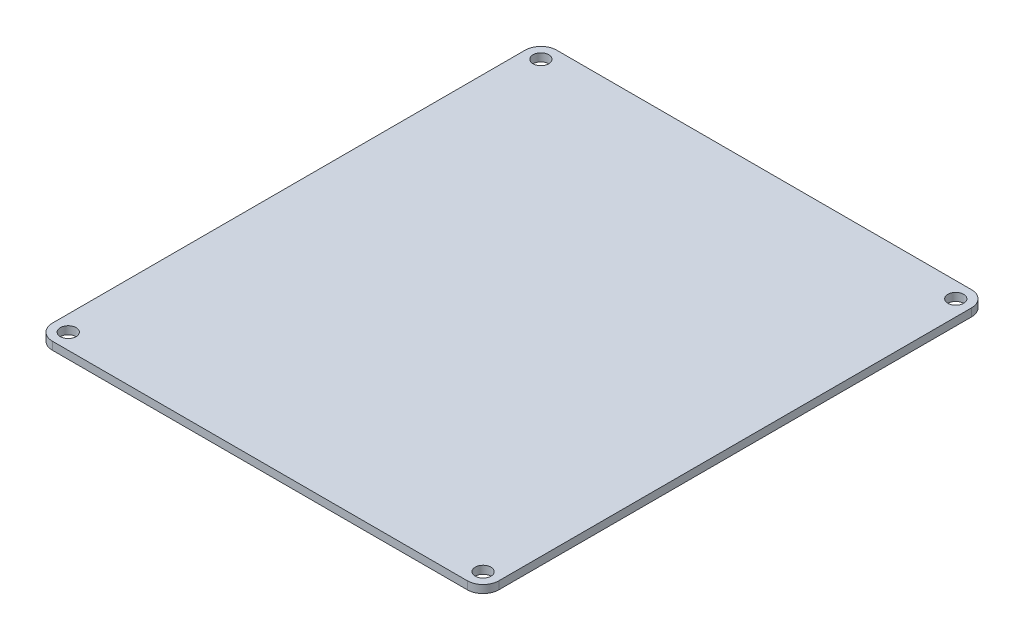
ISO-10303-21;
HEADER;
FILE_DESCRIPTION(('STEP AP214'),'2;1');
FILE_NAME('part.step','',(''),(''),'','','');
FILE_SCHEMA(('AUTOMOTIVE_DESIGN { 1 0 10303 214 1 1 1 1 }'));
ENDSEC;
DATA;
#1=APPLICATION_CONTEXT('core data for automotive mechanical design processes');
#2=APPLICATION_PROTOCOL_DEFINITION('international standard','automotive_design',2000,#1);
#3=PRODUCT_CONTEXT('',#1,'mechanical');
#4=PRODUCT('Part','Part','',(#3));
#5=PRODUCT_RELATED_PRODUCT_CATEGORY('part','',(#4));
#6=PRODUCT_DEFINITION_FORMATION('','',#4);
#7=PRODUCT_DEFINITION_CONTEXT('part definition',#1,'design');
#8=PRODUCT_DEFINITION('design','',#6,#7);
#9=PRODUCT_DEFINITION_SHAPE('','',#8);
#10=(LENGTH_UNIT() NAMED_UNIT(*) SI_UNIT(.MILLI.,.METRE.));
#11=(NAMED_UNIT(*) PLANE_ANGLE_UNIT() SI_UNIT($,.RADIAN.));
#12=(NAMED_UNIT(*) SI_UNIT($,.STERADIAN.) SOLID_ANGLE_UNIT());
#13=UNCERTAINTY_MEASURE_WITH_UNIT(LENGTH_MEASURE(1.E-05),#10,'distance_accuracy_value','');
#14=(GEOMETRIC_REPRESENTATION_CONTEXT(3) GLOBAL_UNCERTAINTY_ASSIGNED_CONTEXT((#13)) GLOBAL_UNIT_ASSIGNED_CONTEXT((#10,
#11,#12)) REPRESENTATION_CONTEXT('',''));
#15=CARTESIAN_POINT('',(0.,0.,0.));
#16=DIRECTION('',(0.,0.,1.));
#17=DIRECTION('',(1.,0.,0.));
#18=AXIS2_PLACEMENT_3D('',#15,#16,#17);
#19=CARTESIAN_POINT('',(-32.800000186,3.175,0.));
#20=DIRECTION('',(1.,0.,0.));
#21=DIRECTION('',(0.,0.,-1.));
#22=AXIS2_PLACEMENT_3D('',#19,#20,#21);
#23=PLANE('',#22);
#24=DIRECTION('',(0.,0.,1.));
#25=VECTOR('',#24,1.);
#26=CARTESIAN_POINT('',(-32.800000186,3.175,0.));
#27=LINE('',#26,#25);
#28=CARTESIAN_POINT('',(-32.800000186,3.175,-196.85));
#29=VERTEX_POINT('',#28);
#30=CARTESIAN_POINT('',(-32.800000186,3.175,-6.35));
#31=VERTEX_POINT('',#30);
#32=EDGE_CURVE('E123',#29,#31,#27,.T.);
#33=ORIENTED_EDGE('',*,*,#32,.F.);
#34=DIRECTION('',(0.,-1.,0.));
#35=VECTOR('',#34,1.);
#36=CARTESIAN_POINT('',(-32.800000186,3.175,-196.85));
#37=LINE('',#36,#35);
#38=CARTESIAN_POINT('',(-32.800000186,0.,-196.85));
#39=VERTEX_POINT('',#38);
#40=EDGE_CURVE('E108',#29,#39,#37,.T.);
#41=ORIENTED_EDGE('',*,*,#40,.T.);
#42=DIRECTION('',(0.,0.,1.));
#43=VECTOR('',#42,1.);
#44=CARTESIAN_POINT('',(-32.800000186,0.,0.));
#45=LINE('',#44,#43);
#46=CARTESIAN_POINT('',(-32.800000186,0.,-6.35));
#47=VERTEX_POINT('',#46);
#48=EDGE_CURVE('E120',#39,#47,#45,.T.);
#49=ORIENTED_EDGE('',*,*,#48,.T.);
#50=DIRECTION('',(0.,-1.,0.));
#51=VECTOR('',#50,1.);
#52=CARTESIAN_POINT('',(-32.800000186,3.175,-6.35));
#53=LINE('',#52,#51);
#54=EDGE_CURVE('E125',#47,#31,#53,.F.);
#55=ORIENTED_EDGE('',*,*,#54,.T.);
#56=EDGE_LOOP('',(#33,#41,#49,#55));
#57=FACE_BOUND('',#56,.T.);
#58=ADVANCED_FACE('F38',(#57),#23,.F.);
#59=CARTESIAN_POINT('',(0.,3.175,0.));
#60=DIRECTION('',(0.,0.,-1.));
#61=DIRECTION('',(-1.,0.,0.));
#62=AXIS2_PLACEMENT_3D('',#59,#60,#61);
#63=PLANE('',#62);
#64=DIRECTION('',(1.,0.,0.));
#65=VECTOR('',#64,1.);
#66=CARTESIAN_POINT('',(0.,0.,0.));
#67=LINE('',#66,#65);
#68=CARTESIAN_POINT('',(-26.450000186,0.,0.));
#69=VERTEX_POINT('',#68);
#70=CARTESIAN_POINT('',(140.750000186,0.,0.));
#71=VERTEX_POINT('',#70);
#72=EDGE_CURVE('E129',#69,#71,#67,.T.);
#73=ORIENTED_EDGE('',*,*,#72,.T.);
#74=DIRECTION('',(0.,-1.,0.));
#75=VECTOR('',#74,1.);
#76=CARTESIAN_POINT('',(140.750000186,3.175,0.));
#77=LINE('',#76,#75);
#78=CARTESIAN_POINT('',(140.750000186,3.175,0.));
#79=VERTEX_POINT('',#78);
#80=EDGE_CURVE('E11',#71,#79,#77,.F.);
#81=ORIENTED_EDGE('',*,*,#80,.T.);
#82=DIRECTION('',(1.,0.,0.));
#83=VECTOR('',#82,1.);
#84=CARTESIAN_POINT('',(0.,3.175,0.));
#85=LINE('',#84,#83);
#86=CARTESIAN_POINT('',(-26.450000186,3.175,0.));
#87=VERTEX_POINT('',#86);
#88=EDGE_CURVE('E169',#87,#79,#85,.T.);
#89=ORIENTED_EDGE('',*,*,#88,.F.);
#90=DIRECTION('',(0.,-1.,0.));
#91=VECTOR('',#90,1.);
#92=CARTESIAN_POINT('',(-26.450000186,3.175,0.));
#93=LINE('',#92,#91);
#94=EDGE_CURVE('E46',#87,#69,#93,.T.);
#95=ORIENTED_EDGE('',*,*,#94,.T.);
#96=EDGE_LOOP('',(#73,#81,#89,#95));
#97=FACE_BOUND('',#96,.T.);
#98=ADVANCED_FACE('F167',(#97),#63,.F.);
#99=CARTESIAN_POINT('',(147.100000186,3.175,0.));
#100=DIRECTION('',(-1.,0.,0.));
#101=DIRECTION('',(0.,0.,1.));
#102=AXIS2_PLACEMENT_3D('',#99,#100,#101);
#103=PLANE('',#102);
#104=DIRECTION('',(0.,0.,-1.));
#105=VECTOR('',#104,1.);
#106=CARTESIAN_POINT('',(147.100000186,0.,0.));
#107=LINE('',#106,#105);
#108=CARTESIAN_POINT('',(147.100000186,0.,-6.35));
#109=VERTEX_POINT('',#108);
#110=CARTESIAN_POINT('',(147.100000186,0.,-196.85));
#111=VERTEX_POINT('',#110);
#112=EDGE_CURVE('E133',#109,#111,#107,.T.);
#113=ORIENTED_EDGE('',*,*,#112,.T.);
#114=DIRECTION('',(0.,-1.,0.));
#115=VECTOR('',#114,1.);
#116=CARTESIAN_POINT('',(147.100000186,3.175,-196.85));
#117=LINE('',#116,#115);
#118=CARTESIAN_POINT('',(147.100000186,3.175,-196.85));
#119=VERTEX_POINT('',#118);
#120=EDGE_CURVE('E53',#111,#119,#117,.F.);
#121=ORIENTED_EDGE('',*,*,#120,.T.);
#122=DIRECTION('',(0.,0.,-1.));
#123=VECTOR('',#122,1.);
#124=CARTESIAN_POINT('',(147.100000186,3.175,0.));
#125=LINE('',#124,#123);
#126=CARTESIAN_POINT('',(147.100000186,3.175,-6.35));
#127=VERTEX_POINT('',#126);
#128=EDGE_CURVE('E177',#127,#119,#125,.T.);
#129=ORIENTED_EDGE('',*,*,#128,.F.);
#130=DIRECTION('',(0.,-1.,0.));
#131=VECTOR('',#130,1.);
#132=CARTESIAN_POINT('',(147.100000186,3.175,-6.35));
#133=LINE('',#132,#131);
#134=EDGE_CURVE('E160',#127,#109,#133,.T.);
#135=ORIENTED_EDGE('',*,*,#134,.T.);
#136=EDGE_LOOP('',(#113,#121,#129,#135));
#137=FACE_BOUND('',#136,.T.);
#138=ADVANCED_FACE('F176',(#137),#103,.F.);
#139=CARTESIAN_POINT('',(140.750000186,3.175,-196.85));
#140=DIRECTION('',(0.,-1.,0.));
#141=DIRECTION('',(0.,0.,-1.));
#142=AXIS2_PLACEMENT_3D('',#139,#140,#141);
#143=CYLINDRICAL_SURFACE('',#142,3.175);
#144=CARTESIAN_POINT('',(140.750000186,3.175,-196.85));
#145=DIRECTION('',(0.,1.,0.));
#146=DIRECTION('',(0.,0.,1.));
#147=AXIS2_PLACEMENT_3D('',#144,#145,#146);
#148=CIRCLE('',#147,3.175);
#149=CARTESIAN_POINT('',(140.750000186,3.175,-193.675));
#150=VERTEX_POINT('',#149);
#151=EDGE_CURVE('E244',#150,#150,#148,.T.);
#152=ORIENTED_EDGE('',*,*,#151,.T.);
#153=EDGE_LOOP('',(#152));
#154=FACE_BOUND('',#153,.T.);
#155=CARTESIAN_POINT('',(140.750000186,0.,-196.85));
#156=DIRECTION('',(0.,1.,0.));
#157=DIRECTION('',(0.,0.,1.));
#158=AXIS2_PLACEMENT_3D('',#155,#156,#157);
#159=CIRCLE('',#158,3.175);
#160=CARTESIAN_POINT('',(140.750000186,0.,-193.675));
#161=VERTEX_POINT('',#160);
#162=EDGE_CURVE('E130',#161,#161,#159,.T.);
#163=ORIENTED_EDGE('',*,*,#162,.F.);
#164=EDGE_LOOP('',(#163));
#165=FACE_BOUND('',#164,.T.);
#166=ADVANCED_FACE('F198',(#154,#165),#143,.F.);
#167=CARTESIAN_POINT('',(140.750000186,3.175,-6.35000000000002));
#168=DIRECTION('',(0.,-1.,0.));
#169=DIRECTION('',(0.,0.,-1.));
#170=AXIS2_PLACEMENT_3D('',#167,#168,#169);
#171=CYLINDRICAL_SURFACE('',#170,3.175);
#172=CARTESIAN_POINT('',(140.750000186,3.175,-6.35000000000002));
#173=DIRECTION('',(0.,1.,0.));
#174=DIRECTION('',(0.,0.,1.));
#175=AXIS2_PLACEMENT_3D('',#172,#173,#174);
#176=CIRCLE('',#175,3.175);
#177=CARTESIAN_POINT('',(140.750000186,3.175,-3.17500000000003));
#178=VERTEX_POINT('',#177);
#179=EDGE_CURVE('E241',#178,#178,#176,.T.);
#180=ORIENTED_EDGE('',*,*,#179,.T.);
#181=EDGE_LOOP('',(#180));
#182=FACE_BOUND('',#181,.T.);
#183=CARTESIAN_POINT('',(140.750000186,0.,-6.35000000000002));
#184=DIRECTION('',(0.,1.,0.));
#185=DIRECTION('',(0.,0.,1.));
#186=AXIS2_PLACEMENT_3D('',#183,#184,#185);
#187=CIRCLE('',#186,3.175);
#188=CARTESIAN_POINT('',(140.750000186,0.,-3.17500000000003));
#189=VERTEX_POINT('',#188);
#190=EDGE_CURVE('E136',#189,#189,#187,.T.);
#191=ORIENTED_EDGE('',*,*,#190,.F.);
#192=EDGE_LOOP('',(#191));
#193=FACE_BOUND('',#192,.T.);
#194=ADVANCED_FACE('F195',(#182,#193),#171,.F.);
#195=CARTESIAN_POINT('',(-26.450000186,3.175,-196.85));
#196=DIRECTION('',(0.,-1.,0.));
#197=DIRECTION('',(0.,0.,-1.));
#198=AXIS2_PLACEMENT_3D('',#195,#196,#197);
#199=CYLINDRICAL_SURFACE('',#198,3.17499999999998);
#200=CARTESIAN_POINT('',(-26.450000186,3.175,-196.85));
#201=DIRECTION('',(0.,1.,0.));
#202=DIRECTION('',(0.,0.,1.));
#203=AXIS2_PLACEMENT_3D('',#200,#201,#202);
#204=CIRCLE('',#203,3.17499999999998);
#205=CARTESIAN_POINT('',(-26.450000186,3.175,-193.675));
#206=VERTEX_POINT('',#205);
#207=EDGE_CURVE('E238',#206,#206,#204,.T.);
#208=ORIENTED_EDGE('',*,*,#207,.T.);
#209=EDGE_LOOP('',(#208));
#210=FACE_BOUND('',#209,.T.);
#211=CARTESIAN_POINT('',(-26.450000186,0.,-196.85));
#212=DIRECTION('',(0.,1.,0.));
#213=DIRECTION('',(0.,0.,1.));
#214=AXIS2_PLACEMENT_3D('',#211,#212,#213);
#215=CIRCLE('',#214,3.17499999999998);
#216=CARTESIAN_POINT('',(-26.450000186,0.,-193.675));
#217=VERTEX_POINT('',#216);
#218=EDGE_CURVE('E188',#217,#217,#215,.T.);
#219=ORIENTED_EDGE('',*,*,#218,.F.);
#220=EDGE_LOOP('',(#219));
#221=FACE_BOUND('',#220,.T.);
#222=ADVANCED_FACE('F197',(#210,#221),#199,.F.);
#223=CARTESIAN_POINT('',(-26.450000186,3.175,-6.34999999999997));
#224=DIRECTION('',(0.,-1.,0.));
#225=DIRECTION('',(0.,0.,-1.));
#226=AXIS2_PLACEMENT_3D('',#223,#224,#225);
#227=CYLINDRICAL_SURFACE('',#226,3.17499999999998);
#228=CARTESIAN_POINT('',(-26.450000186,3.175,-6.34999999999997));
#229=DIRECTION('',(0.,1.,0.));
#230=DIRECTION('',(0.,0.,1.));
#231=AXIS2_PLACEMENT_3D('',#228,#229,#230);
#232=CIRCLE('',#231,3.17499999999998);
#233=CARTESIAN_POINT('',(-26.450000186,3.175,-3.17499999999998));
#234=VERTEX_POINT('',#233);
#235=EDGE_CURVE('E143',#234,#234,#232,.T.);
#236=ORIENTED_EDGE('',*,*,#235,.T.);
#237=EDGE_LOOP('',(#236));
#238=FACE_BOUND('',#237,.T.);
#239=CARTESIAN_POINT('',(-26.450000186,0.,-6.34999999999997));
#240=DIRECTION('',(0.,1.,0.));
#241=DIRECTION('',(0.,0.,1.));
#242=AXIS2_PLACEMENT_3D('',#239,#240,#241);
#243=CIRCLE('',#242,3.17499999999998);
#244=CARTESIAN_POINT('',(-26.450000186,0.,-3.17499999999998));
#245=VERTEX_POINT('',#244);
#246=EDGE_CURVE('E185',#245,#245,#243,.T.);
#247=ORIENTED_EDGE('',*,*,#246,.F.);
#248=EDGE_LOOP('',(#247));
#249=FACE_BOUND('',#248,.T.);
#250=ADVANCED_FACE('F205',(#238,#249),#227,.F.);
#251=CARTESIAN_POINT('',(0.,3.175,-203.2));
#252=DIRECTION('',(0.,0.,1.));
#253=DIRECTION('',(1.,0.,0.));
#254=AXIS2_PLACEMENT_3D('',#251,#252,#253);
#255=PLANE('',#254);
#256=DIRECTION('',(-1.,0.,0.));
#257=VECTOR('',#256,1.);
#258=CARTESIAN_POINT('',(0.,0.,-203.2));
#259=LINE('',#258,#257);
#260=CARTESIAN_POINT('',(140.750000186,0.,-203.2));
#261=VERTEX_POINT('',#260);
#262=CARTESIAN_POINT('',(-26.450000186,0.,-203.2));
#263=VERTEX_POINT('',#262);
#264=EDGE_CURVE('E141',#261,#263,#259,.T.);
#265=ORIENTED_EDGE('',*,*,#264,.T.);
#266=DIRECTION('',(0.,-1.,0.));
#267=VECTOR('',#266,1.);
#268=CARTESIAN_POINT('',(-26.450000186,3.175,-203.2));
#269=LINE('',#268,#267);
#270=CARTESIAN_POINT('',(-26.450000186,3.175,-203.2));
#271=VERTEX_POINT('',#270);
#272=EDGE_CURVE('E109',#263,#271,#269,.F.);
#273=ORIENTED_EDGE('',*,*,#272,.T.);
#274=DIRECTION('',(-1.,0.,0.));
#275=VECTOR('',#274,1.);
#276=CARTESIAN_POINT('',(0.,3.175,-203.2));
#277=LINE('',#276,#275);
#278=CARTESIAN_POINT('',(140.750000186,3.175,-203.2));
#279=VERTEX_POINT('',#278);
#280=EDGE_CURVE('E144',#279,#271,#277,.T.);
#281=ORIENTED_EDGE('',*,*,#280,.F.);
#282=DIRECTION('',(0.,-1.,0.));
#283=VECTOR('',#282,1.);
#284=CARTESIAN_POINT('',(140.750000186,3.175,-203.2));
#285=LINE('',#284,#283);
#286=EDGE_CURVE('E114',#279,#261,#285,.T.);
#287=ORIENTED_EDGE('',*,*,#286,.T.);
#288=EDGE_LOOP('',(#265,#273,#281,#287));
#289=FACE_BOUND('',#288,.T.);
#290=ADVANCED_FACE('F220',(#289),#255,.F.);
#291=CARTESIAN_POINT('',(0.,3.175,0.));
#292=DIRECTION('',(0.,1.,0.));
#293=DIRECTION('',(0.,0.,1.));
#294=AXIS2_PLACEMENT_3D('',#291,#292,#293);
#295=PLANE('',#294);
#296=ORIENTED_EDGE('',*,*,#235,.F.);
#297=EDGE_LOOP('',(#296));
#298=FACE_BOUND('',#297,.T.);
#299=ORIENTED_EDGE('',*,*,#207,.F.);
#300=EDGE_LOOP('',(#299));
#301=FACE_BOUND('',#300,.T.);
#302=ORIENTED_EDGE('',*,*,#179,.F.);
#303=EDGE_LOOP('',(#302));
#304=FACE_BOUND('',#303,.T.);
#305=ORIENTED_EDGE('',*,*,#151,.F.);
#306=EDGE_LOOP('',(#305));
#307=FACE_BOUND('',#306,.T.);
#308=ORIENTED_EDGE('',*,*,#280,.T.);
#309=CARTESIAN_POINT('',(-26.450000186,3.175,-196.85));
#310=DIRECTION('',(0.,1.,0.));
#311=DIRECTION('',(0.,0.,1.));
#312=AXIS2_PLACEMENT_3D('',#309,#310,#311);
#313=CIRCLE('',#312,6.35);
#314=EDGE_CURVE('E158',#271,#29,#313,.T.);
#315=ORIENTED_EDGE('',*,*,#314,.T.);
#316=ORIENTED_EDGE('',*,*,#32,.T.);
#317=CARTESIAN_POINT('',(-26.450000186,3.175,-6.35));
#318=DIRECTION('',(0.,1.,0.));
#319=DIRECTION('',(0.,0.,1.));
#320=AXIS2_PLACEMENT_3D('',#317,#318,#319);
#321=CIRCLE('',#320,6.35);
#322=EDGE_CURVE('E153',#31,#87,#321,.T.);
#323=ORIENTED_EDGE('',*,*,#322,.T.);
#324=ORIENTED_EDGE('',*,*,#88,.T.);
#325=CARTESIAN_POINT('',(140.750000186,3.175,-6.35));
#326=DIRECTION('',(0.,1.,0.));
#327=DIRECTION('',(0.,0.,1.));
#328=AXIS2_PLACEMENT_3D('',#325,#326,#327);
#329=CIRCLE('',#328,6.35);
#330=EDGE_CURVE('E60',#79,#127,#329,.T.);
#331=ORIENTED_EDGE('',*,*,#330,.T.);
#332=ORIENTED_EDGE('',*,*,#128,.T.);
#333=CARTESIAN_POINT('',(140.750000186,3.175,-196.85));
#334=DIRECTION('',(0.,1.,0.));
#335=DIRECTION('',(0.,0.,1.));
#336=AXIS2_PLACEMENT_3D('',#333,#334,#335);
#337=CIRCLE('',#336,6.35);
#338=EDGE_CURVE('E156',#119,#279,#337,.T.);
#339=ORIENTED_EDGE('',*,*,#338,.T.);
#340=EDGE_LOOP('',(#308,#315,#316,#323,#324,#331,#332,#339));
#341=FACE_BOUND('',#340,.T.);
#342=ADVANCED_FACE('F223',(#298,#301,#304,#307,#341),#295,.T.);
#343=CARTESIAN_POINT('',(0.,0.,0.));
#344=DIRECTION('',(0.,1.,0.));
#345=DIRECTION('',(0.,0.,1.));
#346=AXIS2_PLACEMENT_3D('',#343,#344,#345);
#347=PLANE('',#346);
#348=ORIENTED_EDGE('',*,*,#246,.T.);
#349=EDGE_LOOP('',(#348));
#350=FACE_BOUND('',#349,.T.);
#351=ORIENTED_EDGE('',*,*,#218,.T.);
#352=EDGE_LOOP('',(#351));
#353=FACE_BOUND('',#352,.T.);
#354=ORIENTED_EDGE('',*,*,#190,.T.);
#355=EDGE_LOOP('',(#354));
#356=FACE_BOUND('',#355,.T.);
#357=ORIENTED_EDGE('',*,*,#162,.T.);
#358=EDGE_LOOP('',(#357));
#359=FACE_BOUND('',#358,.T.);
#360=ORIENTED_EDGE('',*,*,#48,.F.);
#361=CARTESIAN_POINT('',(-26.450000186,0.,-196.85));
#362=DIRECTION('',(0.,1.,0.));
#363=DIRECTION('',(0.,0.,1.));
#364=AXIS2_PLACEMENT_3D('',#361,#362,#363);
#365=CIRCLE('',#364,6.35);
#366=EDGE_CURVE('E104',#39,#263,#365,.F.);
#367=ORIENTED_EDGE('',*,*,#366,.T.);
#368=ORIENTED_EDGE('',*,*,#264,.F.);
#369=CARTESIAN_POINT('',(140.750000186,0.,-196.85));
#370=DIRECTION('',(0.,1.,0.));
#371=DIRECTION('',(0.,0.,1.));
#372=AXIS2_PLACEMENT_3D('',#369,#370,#371);
#373=CIRCLE('',#372,6.35);
#374=EDGE_CURVE('E115',#261,#111,#373,.F.);
#375=ORIENTED_EDGE('',*,*,#374,.T.);
#376=ORIENTED_EDGE('',*,*,#112,.F.);
#377=CARTESIAN_POINT('',(140.750000186,0.,-6.35));
#378=DIRECTION('',(0.,1.,0.));
#379=DIRECTION('',(0.,0.,1.));
#380=AXIS2_PLACEMENT_3D('',#377,#378,#379);
#381=CIRCLE('',#380,6.35);
#382=EDGE_CURVE('E147',#109,#71,#381,.F.);
#383=ORIENTED_EDGE('',*,*,#382,.T.);
#384=ORIENTED_EDGE('',*,*,#72,.F.);
#385=CARTESIAN_POINT('',(-26.450000186,0.,-6.35));
#386=DIRECTION('',(0.,1.,0.));
#387=DIRECTION('',(0.,0.,1.));
#388=AXIS2_PLACEMENT_3D('',#385,#386,#387);
#389=CIRCLE('',#388,6.35);
#390=EDGE_CURVE('E124',#69,#47,#389,.F.);
#391=ORIENTED_EDGE('',*,*,#390,.T.);
#392=EDGE_LOOP('',(#360,#367,#368,#375,#376,#383,#384,#391));
#393=FACE_BOUND('',#392,.T.);
#394=ADVANCED_FACE('F127',(#350,#353,#356,#359,#393),#347,.F.);
#395=CARTESIAN_POINT('',(-26.450000186,3.175,-196.85));
#396=DIRECTION('',(0.,-1.,0.));
#397=DIRECTION('',(0.,0.,-1.));
#398=AXIS2_PLACEMENT_3D('',#395,#396,#397);
#399=CYLINDRICAL_SURFACE('',#398,6.35);
#400=ORIENTED_EDGE('',*,*,#314,.F.);
#401=ORIENTED_EDGE('',*,*,#272,.F.);
#402=ORIENTED_EDGE('',*,*,#366,.F.);
#403=ORIENTED_EDGE('',*,*,#40,.F.);
#404=EDGE_LOOP('',(#400,#401,#402,#403));
#405=FACE_BOUND('',#404,.T.);
#406=ADVANCED_FACE('F107',(#405),#399,.T.);
#407=CARTESIAN_POINT('',(140.750000186,3.175,-196.85));
#408=DIRECTION('',(0.,-1.,0.));
#409=DIRECTION('',(0.,0.,-1.));
#410=AXIS2_PLACEMENT_3D('',#407,#408,#409);
#411=CYLINDRICAL_SURFACE('',#410,6.35);
#412=ORIENTED_EDGE('',*,*,#338,.F.);
#413=ORIENTED_EDGE('',*,*,#120,.F.);
#414=ORIENTED_EDGE('',*,*,#374,.F.);
#415=ORIENTED_EDGE('',*,*,#286,.F.);
#416=EDGE_LOOP('',(#412,#413,#414,#415));
#417=FACE_BOUND('',#416,.T.);
#418=ADVANCED_FACE('F248',(#417),#411,.T.);
#419=CARTESIAN_POINT('',(140.750000186,3.175,-6.35));
#420=DIRECTION('',(0.,-1.,0.));
#421=DIRECTION('',(0.,0.,-1.));
#422=AXIS2_PLACEMENT_3D('',#419,#420,#421);
#423=CYLINDRICAL_SURFACE('',#422,6.35);
#424=ORIENTED_EDGE('',*,*,#330,.F.);
#425=ORIENTED_EDGE('',*,*,#80,.F.);
#426=ORIENTED_EDGE('',*,*,#382,.F.);
#427=ORIENTED_EDGE('',*,*,#134,.F.);
#428=EDGE_LOOP('',(#424,#425,#426,#427));
#429=FACE_BOUND('',#428,.T.);
#430=ADVANCED_FACE('F175',(#429),#423,.T.);
#431=CARTESIAN_POINT('',(-26.450000186,3.175,-6.35));
#432=DIRECTION('',(0.,-1.,0.));
#433=DIRECTION('',(0.,0.,-1.));
#434=AXIS2_PLACEMENT_3D('',#431,#432,#433);
#435=CYLINDRICAL_SURFACE('',#434,6.35);
#436=ORIENTED_EDGE('',*,*,#322,.F.);
#437=ORIENTED_EDGE('',*,*,#54,.F.);
#438=ORIENTED_EDGE('',*,*,#390,.F.);
#439=ORIENTED_EDGE('',*,*,#94,.F.);
#440=EDGE_LOOP('',(#436,#437,#438,#439));
#441=FACE_BOUND('',#440,.T.);
#442=ADVANCED_FACE('F40',(#441),#435,.T.);
#443=CLOSED_SHELL('',(#58,#98,#138,#166,#194,#222,#250,#290,#342,#394,#406,#418,#430,#442));
#444=MANIFOLD_SOLID_BREP('B2',#443);
#445=ADVANCED_BREP_SHAPE_REPRESENTATION('',(#18,#444),#14);
#446=SHAPE_DEFINITION_REPRESENTATION(#9,#445);
ENDSEC;
END-ISO-10303-21;
